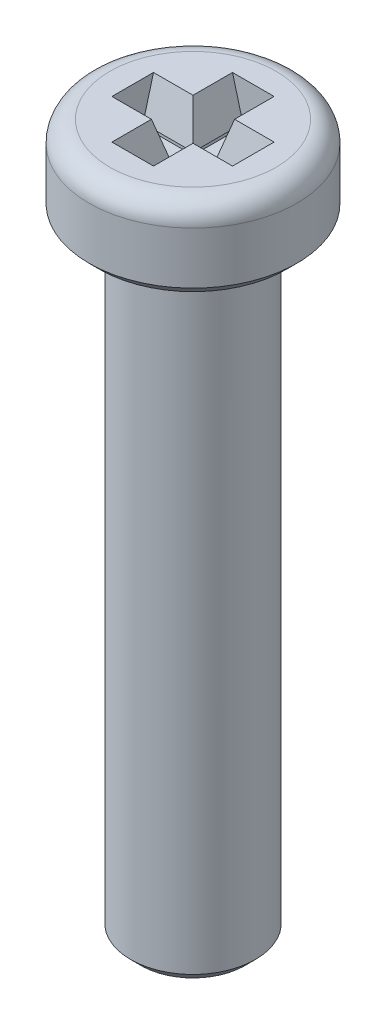
ISO-10303-21;
HEADER;
FILE_DESCRIPTION(('STEP AP214'),'2;1');
FILE_NAME('part.step','',(''),(''),'','','');
FILE_SCHEMA(('AUTOMOTIVE_DESIGN { 1 0 10303 214 1 1 1 1 }'));
ENDSEC;
DATA;
#1=APPLICATION_CONTEXT('core data for automotive mechanical design processes');
#2=APPLICATION_PROTOCOL_DEFINITION('international standard','automotive_design',2000,#1);
#3=PRODUCT_CONTEXT('',#1,'mechanical');
#4=PRODUCT('Part','Part','',(#3));
#5=PRODUCT_RELATED_PRODUCT_CATEGORY('part','',(#4));
#6=PRODUCT_DEFINITION_FORMATION('','',#4);
#7=PRODUCT_DEFINITION_CONTEXT('part definition',#1,'design');
#8=PRODUCT_DEFINITION('design','',#6,#7);
#9=PRODUCT_DEFINITION_SHAPE('','',#8);
#10=(LENGTH_UNIT() NAMED_UNIT(*) SI_UNIT(.MILLI.,.METRE.));
#11=(NAMED_UNIT(*) PLANE_ANGLE_UNIT() SI_UNIT($,.RADIAN.));
#12=(NAMED_UNIT(*) SI_UNIT($,.STERADIAN.) SOLID_ANGLE_UNIT());
#13=UNCERTAINTY_MEASURE_WITH_UNIT(LENGTH_MEASURE(1.E-05),#10,'distance_accuracy_value','');
#14=(GEOMETRIC_REPRESENTATION_CONTEXT(3) GLOBAL_UNCERTAINTY_ASSIGNED_CONTEXT((#13)) GLOBAL_UNIT_ASSIGNED_CONTEXT((#10,
#11,#12)) REPRESENTATION_CONTEXT('',''));
#15=CARTESIAN_POINT('',(0.,0.,0.));
#16=DIRECTION('',(0.,0.,1.));
#17=DIRECTION('',(1.,0.,0.));
#18=AXIS2_PLACEMENT_3D('',#15,#16,#17);
#19=CARTESIAN_POINT('',(0.,2.,0.));
#20=DIRECTION('',(0.,-1.,0.));
#21=DIRECTION('',(0.,0.,-1.));
#22=AXIS2_PLACEMENT_3D('',#19,#20,#21);
#23=CYLINDRICAL_SURFACE('',#22,2.5);
#24=CARTESIAN_POINT('',(0.,1.5,0.));
#25=DIRECTION('',(0.,1.,0.));
#26=DIRECTION('',(0.,0.,1.));
#27=AXIS2_PLACEMENT_3D('',#24,#25,#26);
#28=CIRCLE('',#27,2.5);
#29=CARTESIAN_POINT('',(0.,1.5,2.5));
#30=VERTEX_POINT('',#29);
#31=EDGE_CURVE('E263',#30,#30,#28,.F.);
#32=ORIENTED_EDGE('',*,*,#31,.T.);
#33=EDGE_LOOP('',(#32));
#34=FACE_BOUND('',#33,.T.);
#35=CARTESIAN_POINT('',(0.,0.250000000000003,0.));
#36=DIRECTION('',(0.,1.,0.));
#37=DIRECTION('',(0.,0.,1.));
#38=AXIS2_PLACEMENT_3D('',#35,#36,#37);
#39=CIRCLE('',#38,2.5);
#40=CARTESIAN_POINT('',(0.,0.250000000000003,2.5));
#41=VERTEX_POINT('',#40);
#42=EDGE_CURVE('E254',#41,#41,#39,.T.);
#43=ORIENTED_EDGE('',*,*,#42,.T.);
#44=EDGE_LOOP('',(#43));
#45=FACE_BOUND('',#44,.T.);
#46=ADVANCED_FACE('F32',(#34,#45),#23,.T.);
#47=CARTESIAN_POINT('',(0.,2.,0.));
#48=DIRECTION('',(0.,1.,0.));
#49=DIRECTION('',(0.,0.,1.));
#50=AXIS2_PLACEMENT_3D('',#47,#48,#49);
#51=PLANE('',#50);
#52=DIRECTION('',(1.,0.,0.));
#53=VECTOR('',#52,1.);
#54=CARTESIAN_POINT('',(-0.25,2.,1.45));
#55=LINE('',#54,#53);
#56=CARTESIAN_POINT('',(-0.500000000000001,2.,1.45));
#57=VERTEX_POINT('',#56);
#58=CARTESIAN_POINT('',(0.500000000000001,2.,1.45));
#59=VERTEX_POINT('',#58);
#60=EDGE_CURVE('E211',#57,#59,#55,.T.);
#61=ORIENTED_EDGE('',*,*,#60,.F.);
#62=DIRECTION('',(0.,0.,-1.));
#63=VECTOR('',#62,1.);
#64=CARTESIAN_POINT('',(-0.500000000000001,2.,0.25));
#65=LINE('',#64,#63);
#66=CARTESIAN_POINT('',(-0.500000000000001,2.,0.500000000000001));
#67=VERTEX_POINT('',#66);
#68=EDGE_CURVE('E287',#57,#67,#65,.T.);
#69=ORIENTED_EDGE('',*,*,#68,.T.);
#70=DIRECTION('',(-1.,0.,0.));
#71=VECTOR('',#70,1.);
#72=CARTESIAN_POINT('',(-1.45,2.,0.500000000000001));
#73=LINE('',#72,#71);
#74=CARTESIAN_POINT('',(-1.45,2.,0.500000000000001));
#75=VERTEX_POINT('',#74);
#76=EDGE_CURVE('E284',#67,#75,#73,.T.);
#77=ORIENTED_EDGE('',*,*,#76,.T.);
#78=DIRECTION('',(0.,0.,1.));
#79=VECTOR('',#78,1.);
#80=CARTESIAN_POINT('',(-1.45,2.,0.25));
#81=LINE('',#80,#79);
#82=CARTESIAN_POINT('',(-1.45,2.,-0.500000000000001));
#83=VERTEX_POINT('',#82);
#84=EDGE_CURVE('E209',#83,#75,#81,.T.);
#85=ORIENTED_EDGE('',*,*,#84,.F.);
#86=DIRECTION('',(1.,0.,0.));
#87=VECTOR('',#86,1.);
#88=CARTESIAN_POINT('',(-0.25,2.,-0.500000000000001));
#89=LINE('',#88,#87);
#90=CARTESIAN_POINT('',(-0.500000000000001,2.,-0.500000000000001));
#91=VERTEX_POINT('',#90);
#92=EDGE_CURVE('E272',#83,#91,#89,.T.);
#93=ORIENTED_EDGE('',*,*,#92,.T.);
#94=DIRECTION('',(0.,0.,-1.));
#95=VECTOR('',#94,1.);
#96=CARTESIAN_POINT('',(-0.500000000000001,2.,-1.45));
#97=LINE('',#96,#95);
#98=CARTESIAN_POINT('',(-0.500000000000001,2.,-1.45));
#99=VERTEX_POINT('',#98);
#100=EDGE_CURVE('E269',#91,#99,#97,.T.);
#101=ORIENTED_EDGE('',*,*,#100,.T.);
#102=DIRECTION('',(-1.,0.,0.));
#103=VECTOR('',#102,1.);
#104=CARTESIAN_POINT('',(-0.25,2.,-1.45));
#105=LINE('',#104,#103);
#106=CARTESIAN_POINT('',(0.500000000000001,2.,-1.45));
#107=VERTEX_POINT('',#106);
#108=EDGE_CURVE('E179',#107,#99,#105,.T.);
#109=ORIENTED_EDGE('',*,*,#108,.F.);
#110=DIRECTION('',(0.,0.,1.));
#111=VECTOR('',#110,1.);
#112=CARTESIAN_POINT('',(0.500000000000001,2.,-0.25));
#113=LINE('',#112,#111);
#114=CARTESIAN_POINT('',(0.500000000000001,2.,-0.500000000000001));
#115=VERTEX_POINT('',#114);
#116=EDGE_CURVE('E274',#107,#115,#113,.T.);
#117=ORIENTED_EDGE('',*,*,#116,.T.);
#118=DIRECTION('',(1.,0.,0.));
#119=VECTOR('',#118,1.);
#120=CARTESIAN_POINT('',(1.45,2.,-0.500000000000001));
#121=LINE('',#120,#119);
#122=CARTESIAN_POINT('',(1.45,2.,-0.500000000000001));
#123=VERTEX_POINT('',#122);
#124=EDGE_CURVE('E276',#115,#123,#121,.T.);
#125=ORIENTED_EDGE('',*,*,#124,.T.);
#126=DIRECTION('',(0.,0.,-1.));
#127=VECTOR('',#126,1.);
#128=CARTESIAN_POINT('',(1.45,2.,0.25));
#129=LINE('',#128,#127);
#130=CARTESIAN_POINT('',(1.45,2.,0.500000000000001));
#131=VERTEX_POINT('',#130);
#132=EDGE_CURVE('E181',#131,#123,#129,.T.);
#133=ORIENTED_EDGE('',*,*,#132,.F.);
#134=DIRECTION('',(-1.,0.,0.));
#135=VECTOR('',#134,1.);
#136=CARTESIAN_POINT('',(0.25,2.,0.500000000000001));
#137=LINE('',#136,#135);
#138=CARTESIAN_POINT('',(0.500000000000001,2.,0.500000000000001));
#139=VERTEX_POINT('',#138);
#140=EDGE_CURVE('E279',#131,#139,#137,.T.);
#141=ORIENTED_EDGE('',*,*,#140,.T.);
#142=DIRECTION('',(0.,0.,1.));
#143=VECTOR('',#142,1.);
#144=CARTESIAN_POINT('',(0.500000000000001,2.,1.45));
#145=LINE('',#144,#143);
#146=EDGE_CURVE('E281',#139,#59,#145,.T.);
#147=ORIENTED_EDGE('',*,*,#146,.T.);
#148=EDGE_LOOP('',(#61,#69,#77,#85,#93,#101,#109,#117,#125,#133,#141,#147));
#149=FACE_BOUND('',#148,.T.);
#150=CARTESIAN_POINT('',(0.,2.,0.));
#151=DIRECTION('',(0.,1.,0.));
#152=DIRECTION('',(0.,0.,1.));
#153=AXIS2_PLACEMENT_3D('',#150,#151,#152);
#154=CIRCLE('',#153,2.);
#155=CARTESIAN_POINT('',(0.,2.,2.));
#156=VERTEX_POINT('',#155);
#157=EDGE_CURVE('E260',#156,#156,#154,.T.);
#158=ORIENTED_EDGE('',*,*,#157,.T.);
#159=EDGE_LOOP('',(#158));
#160=FACE_BOUND('',#159,.T.);
#161=ADVANCED_FACE('F338',(#149,#160),#51,.T.);
#162=CARTESIAN_POINT('',(0.,0.,0.));
#163=DIRECTION('',(0.,1.,0.));
#164=DIRECTION('',(0.,0.,1.));
#165=AXIS2_PLACEMENT_3D('',#162,#163,#164);
#166=PLANE('',#165);
#167=CARTESIAN_POINT('',(0.,0.,0.));
#168=DIRECTION('',(0.,1.,0.));
#169=DIRECTION('',(0.,0.,1.));
#170=AXIS2_PLACEMENT_3D('',#167,#168,#169);
#171=CIRCLE('',#170,2.24999999999999);
#172=CARTESIAN_POINT('',(0.,0.,2.24999999999999));
#173=VERTEX_POINT('',#172);
#174=EDGE_CURVE('E257',#173,#173,#171,.F.);
#175=ORIENTED_EDGE('',*,*,#174,.T.);
#176=EDGE_LOOP('',(#175));
#177=FACE_BOUND('',#176,.T.);
#178=CARTESIAN_POINT('',(0.,0.,0.));
#179=DIRECTION('',(0.,1.,0.));
#180=DIRECTION('',(0.,0.,1.));
#181=AXIS2_PLACEMENT_3D('',#178,#179,#180);
#182=CIRCLE('',#181,1.5);
#183=CARTESIAN_POINT('',(0.,0.,1.5));
#184=VERTEX_POINT('',#183);
#185=EDGE_CURVE('E217',#184,#184,#182,.F.);
#186=ORIENTED_EDGE('',*,*,#185,.F.);
#187=EDGE_LOOP('',(#186));
#188=FACE_BOUND('',#187,.T.);
#189=ADVANCED_FACE('F407',(#177,#188),#166,.F.);
#190=CARTESIAN_POINT('',(0.,-15.,0.));
#191=DIRECTION('',(0.,1.,0.));
#192=DIRECTION('',(0.,0.,1.));
#193=AXIS2_PLACEMENT_3D('',#190,#191,#192);
#194=CYLINDRICAL_SURFACE('',#193,1.5);
#195=CARTESIAN_POINT('',(0.,-14.75,0.));
#196=DIRECTION('',(0.,-1.,0.));
#197=DIRECTION('',(0.,0.,-1.));
#198=AXIS2_PLACEMENT_3D('',#195,#196,#197);
#199=CIRCLE('',#198,1.5);
#200=CARTESIAN_POINT('',(0.,-14.75,-1.5));
#201=VERTEX_POINT('',#200);
#202=EDGE_CURVE('E251',#201,#201,#199,.F.);
#203=ORIENTED_EDGE('',*,*,#202,.T.);
#204=EDGE_LOOP('',(#203));
#205=FACE_BOUND('',#204,.T.);
#206=ORIENTED_EDGE('',*,*,#185,.T.);
#207=EDGE_LOOP('',(#206));
#208=FACE_BOUND('',#207,.T.);
#209=ADVANCED_FACE('F461',(#205,#208),#194,.T.);
#210=CARTESIAN_POINT('',(0.,-15.,0.));
#211=DIRECTION('',(0.,-1.,0.));
#212=DIRECTION('',(0.,0.,-1.));
#213=AXIS2_PLACEMENT_3D('',#210,#211,#212);
#214=PLANE('',#213);
#215=CARTESIAN_POINT('',(0.,-15.,0.));
#216=DIRECTION('',(0.,-1.,0.));
#217=DIRECTION('',(0.,0.,-1.));
#218=AXIS2_PLACEMENT_3D('',#215,#216,#217);
#219=CIRCLE('',#218,1.25);
#220=CARTESIAN_POINT('',(0.,-15.,-1.25));
#221=VERTEX_POINT('',#220);
#222=EDGE_CURVE('E248',#221,#221,#219,.T.);
#223=ORIENTED_EDGE('',*,*,#222,.T.);
#224=EDGE_LOOP('',(#223));
#225=FACE_BOUND('',#224,.T.);
#226=ADVANCED_FACE('F416',(#225),#214,.T.);
#227=CARTESIAN_POINT('',(0.,-15.,0.));
#228=DIRECTION('',(0.,1.,0.));
#229=DIRECTION('',(0.,0.,1.));
#230=AXIS2_PLACEMENT_3D('',#227,#228,#229);
#231=CONICAL_SURFACE('',#230,1.25,0.785398163397453);
#232=ORIENTED_EDGE('',*,*,#202,.F.);
#233=EDGE_LOOP('',(#232));
#234=FACE_BOUND('',#233,.T.);
#235=ORIENTED_EDGE('',*,*,#222,.F.);
#236=EDGE_LOOP('',(#235));
#237=FACE_BOUND('',#236,.T.);
#238=ADVANCED_FACE('F412',(#234,#237),#231,.T.);
#239=CARTESIAN_POINT('',(0.,0.250000000000003,0.));
#240=DIRECTION('',(0.,1.,0.));
#241=DIRECTION('',(0.,0.,1.));
#242=AXIS2_PLACEMENT_3D('',#239,#240,#241);
#243=CONICAL_SURFACE('',#242,2.5,0.785398163397455);
#244=ORIENTED_EDGE('',*,*,#174,.F.);
#245=EDGE_LOOP('',(#244));
#246=FACE_BOUND('',#245,.T.);
#247=ORIENTED_EDGE('',*,*,#42,.F.);
#248=EDGE_LOOP('',(#247));
#249=FACE_BOUND('',#248,.T.);
#250=ADVANCED_FACE('F415',(#246,#249),#243,.T.);
#251=CARTESIAN_POINT('',(0.,1.5,0.));
#252=DIRECTION('',(0.,1.,0.));
#253=DIRECTION('',(0.,0.,1.));
#254=AXIS2_PLACEMENT_3D('',#251,#252,#253);
#255=TOROIDAL_SURFACE('',#254,2.,0.5);
#256=ORIENTED_EDGE('',*,*,#31,.F.);
#257=EDGE_LOOP('',(#256));
#258=FACE_BOUND('',#257,.T.);
#259=ORIENTED_EDGE('',*,*,#157,.F.);
#260=EDGE_LOOP('',(#259));
#261=FACE_BOUND('',#260,.T.);
#262=ADVANCED_FACE('F420',(#258,#261),#255,.T.);
#263=CARTESIAN_POINT('',(-0.25,1.,-1.45));
#264=DIRECTION('',(-1.,0.,0.));
#265=DIRECTION('',(0.,0.,1.));
#266=AXIS2_PLACEMENT_3D('',#263,#264,#265);
#267=PLANE('',#266);
#268=DIRECTION('',(0.,1.,0.));
#269=VECTOR('',#268,1.);
#270=CARTESIAN_POINT('',(-0.25,1.,-1.45));
#271=LINE('',#270,#269);
#272=CARTESIAN_POINT('',(-0.25,1.,-1.45));
#273=VERTEX_POINT('',#272);
#274=CARTESIAN_POINT('',(-0.25,1.06698729810778,-1.45));
#275=VERTEX_POINT('',#274);
#276=EDGE_CURVE('E215',#273,#275,#271,.T.);
#277=ORIENTED_EDGE('',*,*,#276,.T.);
#278=DIRECTION('',(0.,0.,1.));
#279=VECTOR('',#278,1.);
#280=CARTESIAN_POINT('',(-0.25,1.06698729810778,-0.25));
#281=LINE('',#280,#279);
#282=CARTESIAN_POINT('',(-0.25,1.06698729810778,-0.25));
#283=VERTEX_POINT('',#282);
#284=EDGE_CURVE('E54',#275,#283,#281,.T.);
#285=ORIENTED_EDGE('',*,*,#284,.T.);
#286=DIRECTION('',(0.,1.,0.));
#287=VECTOR('',#286,1.);
#288=CARTESIAN_POINT('',(-0.25,1.,-0.25));
#289=LINE('',#288,#287);
#290=CARTESIAN_POINT('',(-0.25,1.,-0.25));
#291=VERTEX_POINT('',#290);
#292=EDGE_CURVE('E155',#291,#283,#289,.T.);
#293=ORIENTED_EDGE('',*,*,#292,.F.);
#294=DIRECTION('',(0.,0.,1.));
#295=VECTOR('',#294,1.);
#296=CARTESIAN_POINT('',(-0.25,1.,-1.45));
#297=LINE('',#296,#295);
#298=EDGE_CURVE('E159',#273,#291,#297,.T.);
#299=ORIENTED_EDGE('',*,*,#298,.F.);
#300=EDGE_LOOP('',(#277,#285,#293,#299));
#301=FACE_BOUND('',#300,.T.);
#302=ADVANCED_FACE('F157',(#301),#267,.F.);
#303=CARTESIAN_POINT('',(-0.25,1.,-1.45));
#304=DIRECTION('',(0.,0.,-1.));
#305=DIRECTION('',(-1.,0.,0.));
#306=AXIS2_PLACEMENT_3D('',#303,#304,#305);
#307=PLANE('',#306);
#308=ORIENTED_EDGE('',*,*,#108,.T.);
#309=DIRECTION('',(0.258819045102521,-0.965925826289068,0.));
#310=VECTOR('',#309,1.);
#311=CARTESIAN_POINT('',(-0.233253175473056,1.00448729810778,-1.45));
#312=LINE('',#311,#310);
#313=EDGE_CURVE('E11',#99,#275,#312,.T.);
#314=ORIENTED_EDGE('',*,*,#313,.T.);
#315=ORIENTED_EDGE('',*,*,#276,.F.);
#316=DIRECTION('',(-1.,0.,0.));
#317=VECTOR('',#316,1.);
#318=CARTESIAN_POINT('',(-0.25,1.,-1.45));
#319=LINE('',#318,#317);
#320=CARTESIAN_POINT('',(0.25,1.,-1.45));
#321=VERTEX_POINT('',#320);
#322=EDGE_CURVE('E165',#321,#273,#319,.T.);
#323=ORIENTED_EDGE('',*,*,#322,.F.);
#324=DIRECTION('',(0.,1.,0.));
#325=VECTOR('',#324,1.);
#326=CARTESIAN_POINT('',(0.25,1.,-1.45));
#327=LINE('',#326,#325);
#328=CARTESIAN_POINT('',(0.25,1.06698729810778,-1.45));
#329=VERTEX_POINT('',#328);
#330=EDGE_CURVE('E218',#321,#329,#327,.T.);
#331=ORIENTED_EDGE('',*,*,#330,.T.);
#332=DIRECTION('',(0.258819045102521,0.965925826289068,0.));
#333=VECTOR('',#332,1.);
#334=CARTESIAN_POINT('',(0.199759526419165,0.87948729810778,-1.45));
#335=LINE('',#334,#333);
#336=EDGE_CURVE('E316',#329,#107,#335,.T.);
#337=ORIENTED_EDGE('',*,*,#336,.T.);
#338=EDGE_LOOP('',(#308,#314,#315,#323,#331,#337));
#339=FACE_BOUND('',#338,.T.);
#340=ADVANCED_FACE('F375',(#339),#307,.F.);
#341=CARTESIAN_POINT('',(0.25,1.,-1.45));
#342=DIRECTION('',(1.,0.,0.));
#343=DIRECTION('',(0.,0.,-1.));
#344=AXIS2_PLACEMENT_3D('',#341,#342,#343);
#345=PLANE('',#344);
#346=DIRECTION('',(0.,1.,0.));
#347=VECTOR('',#346,1.);
#348=CARTESIAN_POINT('',(0.25,1.,-0.25));
#349=LINE('',#348,#347);
#350=CARTESIAN_POINT('',(0.25,1.,-0.25));
#351=VERTEX_POINT('',#350);
#352=CARTESIAN_POINT('',(0.25,1.06698729810778,-0.25));
#353=VERTEX_POINT('',#352);
#354=EDGE_CURVE('E221',#351,#353,#349,.T.);
#355=ORIENTED_EDGE('',*,*,#354,.T.);
#356=DIRECTION('',(0.,0.,-1.));
#357=VECTOR('',#356,1.);
#358=CARTESIAN_POINT('',(0.25,1.06698729810778,-1.45));
#359=LINE('',#358,#357);
#360=EDGE_CURVE('E299',#353,#329,#359,.T.);
#361=ORIENTED_EDGE('',*,*,#360,.T.);
#362=ORIENTED_EDGE('',*,*,#330,.F.);
#363=DIRECTION('',(0.,0.,-1.));
#364=VECTOR('',#363,1.);
#365=CARTESIAN_POINT('',(0.25,1.,-1.45));
#366=LINE('',#365,#364);
#367=EDGE_CURVE('E206',#351,#321,#366,.T.);
#368=ORIENTED_EDGE('',*,*,#367,.F.);
#369=EDGE_LOOP('',(#355,#361,#362,#368));
#370=FACE_BOUND('',#369,.T.);
#371=ADVANCED_FACE('F373',(#370),#345,.F.);
#372=CARTESIAN_POINT('',(0.25,1.,-0.25));
#373=DIRECTION('',(0.,0.,-1.));
#374=DIRECTION('',(-1.,0.,0.));
#375=AXIS2_PLACEMENT_3D('',#372,#373,#374);
#376=PLANE('',#375);
#377=DIRECTION('',(0.,1.,0.));
#378=VECTOR('',#377,1.);
#379=CARTESIAN_POINT('',(1.45,1.,-0.25));
#380=LINE('',#379,#378);
#381=CARTESIAN_POINT('',(1.45,1.,-0.25));
#382=VERTEX_POINT('',#381);
#383=CARTESIAN_POINT('',(1.45,1.06698729810778,-0.25));
#384=VERTEX_POINT('',#383);
#385=EDGE_CURVE('E224',#382,#384,#380,.T.);
#386=ORIENTED_EDGE('',*,*,#385,.T.);
#387=DIRECTION('',(-1.,0.,0.));
#388=VECTOR('',#387,1.);
#389=CARTESIAN_POINT('',(0.25,1.06698729810778,-0.25));
#390=LINE('',#389,#388);
#391=EDGE_CURVE('E296',#384,#353,#390,.T.);
#392=ORIENTED_EDGE('',*,*,#391,.T.);
#393=ORIENTED_EDGE('',*,*,#354,.F.);
#394=DIRECTION('',(-1.,0.,0.));
#395=VECTOR('',#394,1.);
#396=CARTESIAN_POINT('',(0.25,1.,-0.25));
#397=LINE('',#396,#395);
#398=EDGE_CURVE('E203',#382,#351,#397,.T.);
#399=ORIENTED_EDGE('',*,*,#398,.F.);
#400=EDGE_LOOP('',(#386,#392,#393,#399));
#401=FACE_BOUND('',#400,.T.);
#402=ADVANCED_FACE('F371',(#401),#376,.F.);
#403=CARTESIAN_POINT('',(1.45,1.,0.25));
#404=DIRECTION('',(1.,0.,0.));
#405=DIRECTION('',(0.,0.,-1.));
#406=AXIS2_PLACEMENT_3D('',#403,#404,#405);
#407=PLANE('',#406);
#408=ORIENTED_EDGE('',*,*,#132,.T.);
#409=DIRECTION('',(0.,-0.965925826289068,0.258819045102521));
#410=VECTOR('',#409,1.);
#411=CARTESIAN_POINT('',(1.45,0.87948729810778,-0.199759526419165));
#412=LINE('',#411,#410);
#413=EDGE_CURVE('E314',#123,#384,#412,.T.);
#414=ORIENTED_EDGE('',*,*,#413,.T.);
#415=ORIENTED_EDGE('',*,*,#385,.F.);
#416=DIRECTION('',(0.,0.,-1.));
#417=VECTOR('',#416,1.);
#418=CARTESIAN_POINT('',(1.45,1.,0.25));
#419=LINE('',#418,#417);
#420=CARTESIAN_POINT('',(1.45,1.,0.25));
#421=VERTEX_POINT('',#420);
#422=EDGE_CURVE('E200',#421,#382,#419,.T.);
#423=ORIENTED_EDGE('',*,*,#422,.F.);
#424=DIRECTION('',(0.,1.,0.));
#425=VECTOR('',#424,1.);
#426=CARTESIAN_POINT('',(1.45,1.,0.25));
#427=LINE('',#426,#425);
#428=CARTESIAN_POINT('',(1.45,1.06698729810778,0.25));
#429=VERTEX_POINT('',#428);
#430=EDGE_CURVE('E227',#421,#429,#427,.T.);
#431=ORIENTED_EDGE('',*,*,#430,.T.);
#432=DIRECTION('',(0.,0.965925826289068,0.258819045102521));
#433=VECTOR('',#432,1.);
#434=CARTESIAN_POINT('',(1.45,1.00448729810778,0.233253175473055));
#435=LINE('',#434,#433);
#436=EDGE_CURVE('E311',#429,#131,#435,.T.);
#437=ORIENTED_EDGE('',*,*,#436,.T.);
#438=EDGE_LOOP('',(#408,#414,#415,#423,#431,#437));
#439=FACE_BOUND('',#438,.T.);
#440=ADVANCED_FACE('F367',(#439),#407,.F.);
#441=CARTESIAN_POINT('',(0.25,1.,0.25));
#442=DIRECTION('',(0.,0.,1.));
#443=DIRECTION('',(1.,0.,0.));
#444=AXIS2_PLACEMENT_3D('',#441,#442,#443);
#445=PLANE('',#444);
#446=DIRECTION('',(0.,1.,0.));
#447=VECTOR('',#446,1.);
#448=CARTESIAN_POINT('',(0.25,1.,0.25));
#449=LINE('',#448,#447);
#450=CARTESIAN_POINT('',(0.25,1.,0.25));
#451=VERTEX_POINT('',#450);
#452=CARTESIAN_POINT('',(0.25,1.06698729810778,0.25));
#453=VERTEX_POINT('',#452);
#454=EDGE_CURVE('E230',#451,#453,#449,.T.);
#455=ORIENTED_EDGE('',*,*,#454,.T.);
#456=DIRECTION('',(1.,0.,0.));
#457=VECTOR('',#456,1.);
#458=CARTESIAN_POINT('',(1.45,1.06698729810778,0.25));
#459=LINE('',#458,#457);
#460=EDGE_CURVE('E294',#453,#429,#459,.T.);
#461=ORIENTED_EDGE('',*,*,#460,.T.);
#462=ORIENTED_EDGE('',*,*,#430,.F.);
#463=DIRECTION('',(1.,0.,0.));
#464=VECTOR('',#463,1.);
#465=CARTESIAN_POINT('',(0.25,1.,0.25));
#466=LINE('',#465,#464);
#467=EDGE_CURVE('E197',#451,#421,#466,.T.);
#468=ORIENTED_EDGE('',*,*,#467,.F.);
#469=EDGE_LOOP('',(#455,#461,#462,#468));
#470=FACE_BOUND('',#469,.T.);
#471=ADVANCED_FACE('F362',(#470),#445,.F.);
#472=CARTESIAN_POINT('',(0.25,1.,0.25));
#473=DIRECTION('',(1.,0.,0.));
#474=DIRECTION('',(0.,0.,-1.));
#475=AXIS2_PLACEMENT_3D('',#472,#473,#474);
#476=PLANE('',#475);
#477=DIRECTION('',(0.,1.,0.));
#478=VECTOR('',#477,1.);
#479=CARTESIAN_POINT('',(0.25,1.,1.45));
#480=LINE('',#479,#478);
#481=CARTESIAN_POINT('',(0.25,1.,1.45));
#482=VERTEX_POINT('',#481);
#483=CARTESIAN_POINT('',(0.25,1.06698729810778,1.45));
#484=VERTEX_POINT('',#483);
#485=EDGE_CURVE('E233',#482,#484,#480,.T.);
#486=ORIENTED_EDGE('',*,*,#485,.T.);
#487=DIRECTION('',(0.,0.,-1.));
#488=VECTOR('',#487,1.);
#489=CARTESIAN_POINT('',(0.25,1.06698729810778,0.25));
#490=LINE('',#489,#488);
#491=EDGE_CURVE('E291',#484,#453,#490,.T.);
#492=ORIENTED_EDGE('',*,*,#491,.T.);
#493=ORIENTED_EDGE('',*,*,#454,.F.);
#494=DIRECTION('',(0.,0.,-1.));
#495=VECTOR('',#494,1.);
#496=CARTESIAN_POINT('',(0.25,1.,0.25));
#497=LINE('',#496,#495);
#498=EDGE_CURVE('E194',#482,#451,#497,.T.);
#499=ORIENTED_EDGE('',*,*,#498,.F.);
#500=EDGE_LOOP('',(#486,#492,#493,#499));
#501=FACE_BOUND('',#500,.T.);
#502=ADVANCED_FACE('F359',(#501),#476,.F.);
#503=CARTESIAN_POINT('',(-0.25,1.,1.45));
#504=DIRECTION('',(0.,0.,1.));
#505=DIRECTION('',(1.,0.,0.));
#506=AXIS2_PLACEMENT_3D('',#503,#504,#505);
#507=PLANE('',#506);
#508=ORIENTED_EDGE('',*,*,#60,.T.);
#509=DIRECTION('',(-0.258819045102521,-0.965925826289068,0.));
#510=VECTOR('',#509,1.);
#511=CARTESIAN_POINT('',(0.199759526419165,0.87948729810778,1.45));
#512=LINE('',#511,#510);
#513=EDGE_CURVE('E309',#59,#484,#512,.T.);
#514=ORIENTED_EDGE('',*,*,#513,.T.);
#515=ORIENTED_EDGE('',*,*,#485,.F.);
#516=DIRECTION('',(1.,0.,0.));
#517=VECTOR('',#516,1.);
#518=CARTESIAN_POINT('',(-0.25,1.,1.45));
#519=LINE('',#518,#517);
#520=CARTESIAN_POINT('',(-0.25,1.,1.45));
#521=VERTEX_POINT('',#520);
#522=EDGE_CURVE('E191',#521,#482,#519,.T.);
#523=ORIENTED_EDGE('',*,*,#522,.F.);
#524=DIRECTION('',(0.,1.,0.));
#525=VECTOR('',#524,1.);
#526=CARTESIAN_POINT('',(-0.25,1.,1.45));
#527=LINE('',#526,#525);
#528=CARTESIAN_POINT('',(-0.25,1.06698729810778,1.45));
#529=VERTEX_POINT('',#528);
#530=EDGE_CURVE('E236',#521,#529,#527,.T.);
#531=ORIENTED_EDGE('',*,*,#530,.T.);
#532=DIRECTION('',(-0.258819045102521,0.965925826289068,0.));
#533=VECTOR('',#532,1.);
#534=CARTESIAN_POINT('',(-0.233253175473055,1.00448729810778,1.45));
#535=LINE('',#534,#533);
#536=EDGE_CURVE('E304',#529,#57,#535,.T.);
#537=ORIENTED_EDGE('',*,*,#536,.T.);
#538=EDGE_LOOP('',(#508,#514,#515,#523,#531,#537));
#539=FACE_BOUND('',#538,.T.);
#540=ADVANCED_FACE('F355',(#539),#507,.F.);
#541=CARTESIAN_POINT('',(-0.25,1.,0.25));
#542=DIRECTION('',(-1.,0.,0.));
#543=DIRECTION('',(0.,0.,1.));
#544=AXIS2_PLACEMENT_3D('',#541,#542,#543);
#545=PLANE('',#544);
#546=DIRECTION('',(0.,1.,0.));
#547=VECTOR('',#546,1.);
#548=CARTESIAN_POINT('',(-0.25,1.,0.25));
#549=LINE('',#548,#547);
#550=CARTESIAN_POINT('',(-0.25,1.,0.25));
#551=VERTEX_POINT('',#550);
#552=CARTESIAN_POINT('',(-0.25,1.06698729810778,0.25));
#553=VERTEX_POINT('',#552);
#554=EDGE_CURVE('E239',#551,#553,#549,.T.);
#555=ORIENTED_EDGE('',*,*,#554,.T.);
#556=DIRECTION('',(0.,0.,1.));
#557=VECTOR('',#556,1.);
#558=CARTESIAN_POINT('',(-0.25,1.06698729810778,1.45));
#559=LINE('',#558,#557);
#560=EDGE_CURVE('E266',#553,#529,#559,.T.);
#561=ORIENTED_EDGE('',*,*,#560,.T.);
#562=ORIENTED_EDGE('',*,*,#530,.F.);
#563=DIRECTION('',(0.,0.,1.));
#564=VECTOR('',#563,1.);
#565=CARTESIAN_POINT('',(-0.25,1.,0.25));
#566=LINE('',#565,#564);
#567=EDGE_CURVE('E188',#551,#521,#566,.T.);
#568=ORIENTED_EDGE('',*,*,#567,.F.);
#569=EDGE_LOOP('',(#555,#561,#562,#568));
#570=FACE_BOUND('',#569,.T.);
#571=ADVANCED_FACE('F351',(#570),#545,.F.);
#572=CARTESIAN_POINT('',(-1.45,1.,0.25));
#573=DIRECTION('',(0.,0.,1.));
#574=DIRECTION('',(1.,0.,0.));
#575=AXIS2_PLACEMENT_3D('',#572,#573,#574);
#576=PLANE('',#575);
#577=DIRECTION('',(0.,1.,0.));
#578=VECTOR('',#577,1.);
#579=CARTESIAN_POINT('',(-1.45,1.,0.25));
#580=LINE('',#579,#578);
#581=CARTESIAN_POINT('',(-1.45,1.,0.25));
#582=VERTEX_POINT('',#581);
#583=CARTESIAN_POINT('',(-1.45,1.06698729810778,0.25));
#584=VERTEX_POINT('',#583);
#585=EDGE_CURVE('E242',#582,#584,#580,.T.);
#586=ORIENTED_EDGE('',*,*,#585,.T.);
#587=DIRECTION('',(1.,0.,0.));
#588=VECTOR('',#587,1.);
#589=CARTESIAN_POINT('',(-0.25,1.06698729810778,0.25));
#590=LINE('',#589,#588);
#591=EDGE_CURVE('E289',#584,#553,#590,.T.);
#592=ORIENTED_EDGE('',*,*,#591,.T.);
#593=ORIENTED_EDGE('',*,*,#554,.F.);
#594=DIRECTION('',(1.,0.,0.));
#595=VECTOR('',#594,1.);
#596=CARTESIAN_POINT('',(-1.45,1.,0.25));
#597=LINE('',#596,#595);
#598=EDGE_CURVE('E185',#582,#551,#597,.T.);
#599=ORIENTED_EDGE('',*,*,#598,.F.);
#600=EDGE_LOOP('',(#586,#592,#593,#599));
#601=FACE_BOUND('',#600,.T.);
#602=ADVANCED_FACE('F347',(#601),#576,.F.);
#603=CARTESIAN_POINT('',(-1.45,1.,0.25));
#604=DIRECTION('',(-1.,0.,0.));
#605=DIRECTION('',(0.,0.,1.));
#606=AXIS2_PLACEMENT_3D('',#603,#604,#605);
#607=PLANE('',#606);
#608=ORIENTED_EDGE('',*,*,#84,.T.);
#609=DIRECTION('',(0.,-0.965925826289068,-0.258819045102521));
#610=VECTOR('',#609,1.);
#611=CARTESIAN_POINT('',(-1.45,1.00448729810778,0.233253175473056));
#612=LINE('',#611,#610);
#613=EDGE_CURVE('E307',#75,#584,#612,.T.);
#614=ORIENTED_EDGE('',*,*,#613,.T.);
#615=ORIENTED_EDGE('',*,*,#585,.F.);
#616=DIRECTION('',(0.,0.,1.));
#617=VECTOR('',#616,1.);
#618=CARTESIAN_POINT('',(-1.45,1.,0.25));
#619=LINE('',#618,#617);
#620=CARTESIAN_POINT('',(-1.45,1.,-0.25));
#621=VERTEX_POINT('',#620);
#622=EDGE_CURVE('E174',#621,#582,#619,.T.);
#623=ORIENTED_EDGE('',*,*,#622,.F.);
#624=DIRECTION('',(0.,1.,0.));
#625=VECTOR('',#624,1.);
#626=CARTESIAN_POINT('',(-1.45,1.,-0.25));
#627=LINE('',#626,#625);
#628=CARTESIAN_POINT('',(-1.45,1.06698729810778,-0.25));
#629=VERTEX_POINT('',#628);
#630=EDGE_CURVE('E164',#621,#629,#627,.T.);
#631=ORIENTED_EDGE('',*,*,#630,.T.);
#632=DIRECTION('',(0.,0.965925826289068,-0.258819045102521));
#633=VECTOR('',#632,1.);
#634=CARTESIAN_POINT('',(-1.45,0.87948729810778,-0.199759526419165));
#635=LINE('',#634,#633);
#636=EDGE_CURVE('E41',#629,#83,#635,.T.);
#637=ORIENTED_EDGE('',*,*,#636,.T.);
#638=EDGE_LOOP('',(#608,#614,#615,#623,#631,#637));
#639=FACE_BOUND('',#638,.T.);
#640=ADVANCED_FACE('F343',(#639),#607,.F.);
#641=CARTESIAN_POINT('',(-1.45,1.,-0.25));
#642=DIRECTION('',(0.,0.,-1.));
#643=DIRECTION('',(-1.,0.,0.));
#644=AXIS2_PLACEMENT_3D('',#641,#642,#643);
#645=PLANE('',#644);
#646=ORIENTED_EDGE('',*,*,#292,.T.);
#647=DIRECTION('',(-1.,0.,0.));
#648=VECTOR('',#647,1.);
#649=CARTESIAN_POINT('',(-1.45,1.06698729810778,-0.25));
#650=LINE('',#649,#648);
#651=EDGE_CURVE('E301',#283,#629,#650,.T.);
#652=ORIENTED_EDGE('',*,*,#651,.T.);
#653=ORIENTED_EDGE('',*,*,#630,.F.);
#654=DIRECTION('',(-1.,0.,0.));
#655=VECTOR('',#654,1.);
#656=CARTESIAN_POINT('',(-1.45,1.,-0.25));
#657=LINE('',#656,#655);
#658=EDGE_CURVE('E168',#291,#621,#657,.T.);
#659=ORIENTED_EDGE('',*,*,#658,.F.);
#660=EDGE_LOOP('',(#646,#652,#653,#659));
#661=FACE_BOUND('',#660,.T.);
#662=ADVANCED_FACE('F169',(#661),#645,.F.);
#663=CARTESIAN_POINT('',(0.,1.,0.));
#664=DIRECTION('',(0.,1.,0.));
#665=DIRECTION('',(0.,0.,1.));
#666=AXIS2_PLACEMENT_3D('',#663,#664,#665);
#667=PLANE('',#666);
#668=ORIENTED_EDGE('',*,*,#298,.T.);
#669=ORIENTED_EDGE('',*,*,#658,.T.);
#670=ORIENTED_EDGE('',*,*,#622,.T.);
#671=ORIENTED_EDGE('',*,*,#598,.T.);
#672=ORIENTED_EDGE('',*,*,#567,.T.);
#673=ORIENTED_EDGE('',*,*,#522,.T.);
#674=ORIENTED_EDGE('',*,*,#498,.T.);
#675=ORIENTED_EDGE('',*,*,#467,.T.);
#676=ORIENTED_EDGE('',*,*,#422,.T.);
#677=ORIENTED_EDGE('',*,*,#398,.T.);
#678=ORIENTED_EDGE('',*,*,#367,.T.);
#679=ORIENTED_EDGE('',*,*,#322,.T.);
#680=EDGE_LOOP('',(#668,#669,#670,#671,#672,#673,#674,#675,#676,#677,#678,#679));
#681=FACE_BOUND('',#680,.T.);
#682=ADVANCED_FACE('F176',(#681),#667,.T.);
#683=CARTESIAN_POINT('',(-1.45,1.06698729810778,0.25));
#684=DIRECTION('',(0.,0.258819045102521,-0.965925826289068));
#685=DIRECTION('',(-1.,0.,0.));
#686=AXIS2_PLACEMENT_3D('',#683,#684,#685);
#687=PLANE('',#686);
#688=ORIENTED_EDGE('',*,*,#613,.F.);
#689=ORIENTED_EDGE('',*,*,#76,.F.);
#690=DIRECTION('',(0.250562807085732,-0.935113126531029,-0.250562807085732));
#691=VECTOR('',#690,1.);
#692=CARTESIAN_POINT('',(-0.325338064353618,1.34815278201937,0.325338064353618));
#693=LINE('',#692,#691);
#694=EDGE_CURVE('E212',#553,#67,#693,.F.);
#695=ORIENTED_EDGE('',*,*,#694,.F.);
#696=ORIENTED_EDGE('',*,*,#591,.F.);
#697=EDGE_LOOP('',(#688,#689,#695,#696));
#698=FACE_BOUND('',#697,.T.);
#699=ADVANCED_FACE('F397',(#698),#687,.T.);
#700=CARTESIAN_POINT('',(-0.25,1.06698729810778,0.25));
#701=DIRECTION('',(0.965925826289068,0.258819045102521,0.));
#702=DIRECTION('',(0.,0.,-1.));
#703=AXIS2_PLACEMENT_3D('',#700,#701,#702);
#704=PLANE('',#703);
#705=ORIENTED_EDGE('',*,*,#694,.T.);
#706=ORIENTED_EDGE('',*,*,#68,.F.);
#707=ORIENTED_EDGE('',*,*,#536,.F.);
#708=ORIENTED_EDGE('',*,*,#560,.F.);
#709=EDGE_LOOP('',(#705,#706,#707,#708));
#710=FACE_BOUND('',#709,.T.);
#711=ADVANCED_FACE('F390',(#710),#704,.T.);
#712=CARTESIAN_POINT('',(0.25,1.06698729810778,0.25));
#713=DIRECTION('',(0.,0.258819045102521,-0.965925826289068));
#714=DIRECTION('',(-1.,0.,0.));
#715=AXIS2_PLACEMENT_3D('',#712,#713,#714);
#716=PLANE('',#715);
#717=ORIENTED_EDGE('',*,*,#436,.F.);
#718=ORIENTED_EDGE('',*,*,#460,.F.);
#719=DIRECTION('',(0.250562807085732,0.935113126531029,0.250562807085732));
#720=VECTOR('',#719,1.);
#721=CARTESIAN_POINT('',(0.25,1.06698729810778,0.25));
#722=LINE('',#721,#720);
#723=EDGE_CURVE('E323',#139,#453,#722,.F.);
#724=ORIENTED_EDGE('',*,*,#723,.F.);
#725=ORIENTED_EDGE('',*,*,#140,.F.);
#726=EDGE_LOOP('',(#717,#718,#724,#725));
#727=FACE_BOUND('',#726,.T.);
#728=ADVANCED_FACE('F388',(#727),#716,.T.);
#729=CARTESIAN_POINT('',(0.25,1.06698729810778,0.25));
#730=DIRECTION('',(-0.965925826289068,0.258819045102521,0.));
#731=DIRECTION('',(0.,0.,1.));
#732=AXIS2_PLACEMENT_3D('',#729,#730,#731);
#733=PLANE('',#732);
#734=ORIENTED_EDGE('',*,*,#513,.F.);
#735=ORIENTED_EDGE('',*,*,#146,.F.);
#736=ORIENTED_EDGE('',*,*,#723,.T.);
#737=ORIENTED_EDGE('',*,*,#491,.F.);
#738=EDGE_LOOP('',(#734,#735,#736,#737));
#739=FACE_BOUND('',#738,.T.);
#740=ADVANCED_FACE('F387',(#739),#733,.T.);
#741=CARTESIAN_POINT('',(0.25,1.06698729810778,-1.45));
#742=DIRECTION('',(-0.965925826289068,0.258819045102521,0.));
#743=DIRECTION('',(0.,0.,1.));
#744=AXIS2_PLACEMENT_3D('',#741,#742,#743);
#745=PLANE('',#744);
#746=ORIENTED_EDGE('',*,*,#336,.F.);
#747=ORIENTED_EDGE('',*,*,#360,.F.);
#748=DIRECTION('',(0.250562807085732,0.935113126531029,-0.250562807085732));
#749=VECTOR('',#748,1.);
#750=CARTESIAN_POINT('',(0.325338064353618,1.34815278201937,-0.325338064353618));
#751=LINE('',#750,#749);
#752=EDGE_CURVE('E324',#115,#353,#751,.F.);
#753=ORIENTED_EDGE('',*,*,#752,.F.);
#754=ORIENTED_EDGE('',*,*,#116,.F.);
#755=EDGE_LOOP('',(#746,#747,#753,#754));
#756=FACE_BOUND('',#755,.T.);
#757=ADVANCED_FACE('F378',(#756),#745,.T.);
#758=CARTESIAN_POINT('',(0.25,1.06698729810778,-0.25));
#759=DIRECTION('',(0.,0.258819045102521,0.965925826289068));
#760=DIRECTION('',(1.,0.,0.));
#761=AXIS2_PLACEMENT_3D('',#758,#759,#760);
#762=PLANE('',#761);
#763=ORIENTED_EDGE('',*,*,#413,.F.);
#764=ORIENTED_EDGE('',*,*,#124,.F.);
#765=ORIENTED_EDGE('',*,*,#752,.T.);
#766=ORIENTED_EDGE('',*,*,#391,.F.);
#767=EDGE_LOOP('',(#763,#764,#765,#766));
#768=FACE_BOUND('',#767,.T.);
#769=ADVANCED_FACE('F380',(#768),#762,.T.);
#770=CARTESIAN_POINT('',(-0.25,1.06698729810778,-1.45));
#771=DIRECTION('',(0.965925826289068,0.258819045102521,0.));
#772=DIRECTION('',(0.,0.,-1.));
#773=AXIS2_PLACEMENT_3D('',#770,#771,#772);
#774=PLANE('',#773);
#775=ORIENTED_EDGE('',*,*,#313,.F.);
#776=ORIENTED_EDGE('',*,*,#100,.F.);
#777=DIRECTION('',(0.250562807085732,-0.935113126531029,0.250562807085732));
#778=VECTOR('',#777,1.);
#779=CARTESIAN_POINT('',(-0.325338064353618,1.34815278201937,-0.325338064353618));
#780=LINE('',#779,#778);
#781=EDGE_CURVE('E36',#283,#91,#780,.F.);
#782=ORIENTED_EDGE('',*,*,#781,.F.);
#783=ORIENTED_EDGE('',*,*,#284,.F.);
#784=EDGE_LOOP('',(#775,#776,#782,#783));
#785=FACE_BOUND('',#784,.T.);
#786=ADVANCED_FACE('F34',(#785),#774,.T.);
#787=CARTESIAN_POINT('',(-1.45,1.06698729810778,-0.25));
#788=DIRECTION('',(0.,0.258819045102521,0.965925826289068));
#789=DIRECTION('',(1.,0.,0.));
#790=AXIS2_PLACEMENT_3D('',#787,#788,#789);
#791=PLANE('',#790);
#792=ORIENTED_EDGE('',*,*,#781,.T.);
#793=ORIENTED_EDGE('',*,*,#92,.F.);
#794=ORIENTED_EDGE('',*,*,#636,.F.);
#795=ORIENTED_EDGE('',*,*,#651,.F.);
#796=EDGE_LOOP('',(#792,#793,#794,#795));
#797=FACE_BOUND('',#796,.T.);
#798=ADVANCED_FACE('F334',(#797),#791,.T.);
#799=CLOSED_SHELL('',(#46,#161,#189,#209,#226,#238,#250,#262,#302,#340,#371,#402,#440,#471,#502,
#540,#571,#602,#640,#662,#682,#699,#711,#728,#740,#757,#769,#786,#798));
#800=MANIFOLD_SOLID_BREP('B2',#799);
#801=ADVANCED_BREP_SHAPE_REPRESENTATION('',(#18,#800),#14);
#802=SHAPE_DEFINITION_REPRESENTATION(#9,#801);
ENDSEC;
END-ISO-10303-21;
